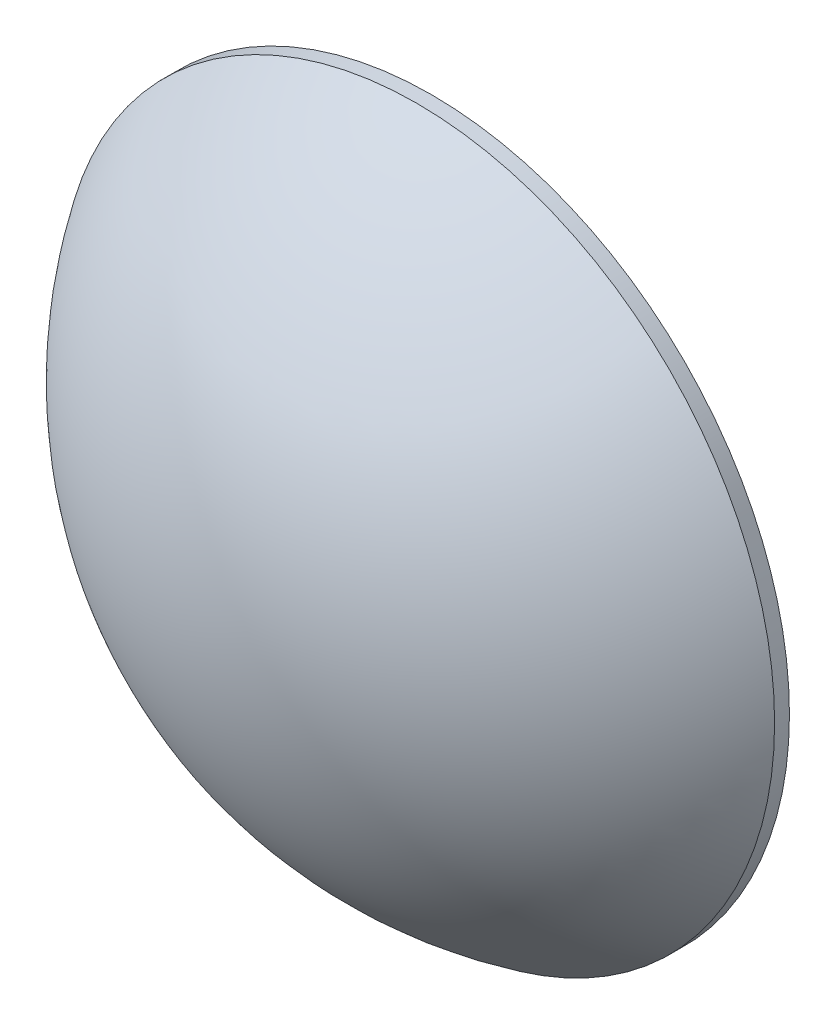
ISO-10303-21;
HEADER;
FILE_DESCRIPTION(('STEP AP214'),'2;1');
FILE_NAME('part.step','',(''),(''),'','','');
FILE_SCHEMA(('AUTOMOTIVE_DESIGN { 1 0 10303 214 1 1 1 1 }'));
ENDSEC;
DATA;
#1=APPLICATION_CONTEXT('core data for automotive mechanical design processes');
#2=APPLICATION_PROTOCOL_DEFINITION('international standard','automotive_design',2000,#1);
#3=PRODUCT_CONTEXT('',#1,'mechanical');
#4=PRODUCT('Part','Part','',(#3));
#5=PRODUCT_RELATED_PRODUCT_CATEGORY('part','',(#4));
#6=PRODUCT_DEFINITION_FORMATION('','',#4);
#7=PRODUCT_DEFINITION_CONTEXT('part definition',#1,'design');
#8=PRODUCT_DEFINITION('design','',#6,#7);
#9=PRODUCT_DEFINITION_SHAPE('','',#8);
#10=(LENGTH_UNIT() NAMED_UNIT(*) SI_UNIT(.MILLI.,.METRE.));
#11=(NAMED_UNIT(*) PLANE_ANGLE_UNIT() SI_UNIT($,.RADIAN.));
#12=(NAMED_UNIT(*) SI_UNIT($,.STERADIAN.) SOLID_ANGLE_UNIT());
#13=UNCERTAINTY_MEASURE_WITH_UNIT(LENGTH_MEASURE(1.E-05),#10,'distance_accuracy_value','');
#14=(GEOMETRIC_REPRESENTATION_CONTEXT(3) GLOBAL_UNCERTAINTY_ASSIGNED_CONTEXT((#13)) GLOBAL_UNIT_ASSIGNED_CONTEXT((#10,
#11,#12)) REPRESENTATION_CONTEXT('',''));
#15=CARTESIAN_POINT('',(0.,0.,0.));
#16=DIRECTION('',(0.,0.,1.));
#17=DIRECTION('',(1.,0.,0.));
#18=AXIS2_PLACEMENT_3D('',#15,#16,#17);
#19=CARTESIAN_POINT('',(0.,0.,-22.9399588138106));
#20=DIRECTION('',(0.,0.,1.));
#21=DIRECTION('',(0.,1.,0.));
#22=AXIS2_PLACEMENT_3D('',#19,#20,#21);
#23=SPHERICAL_SURFACE('',#22,30.34);
#24=CARTESIAN_POINT('',(0.,0.,-6.34611658242851));
#25=DIRECTION('',(0.,0.,1.));
#26=DIRECTION('',(1.,0.,0.));
#27=AXIS2_PLACEMENT_3D('',#24,#25,#26);
#28=CIRCLE('',#27,25.4);
#29=CARTESIAN_POINT('',(25.4,0.,-6.34611658242851));
#30=VERTEX_POINT('',#29);
#31=EDGE_CURVE('E8',#30,#30,#28,.T.);
#32=ORIENTED_EDGE('',*,*,#31,.T.);
#33=EDGE_LOOP('',(#32));
#34=FACE_BOUND('',#33,.T.);
#35=ADVANCED_FACE('F12',(#34),#23,.T.);
#36=CARTESIAN_POINT('',(0.,0.,11.4551449410304));
#37=DIRECTION('',(0.,0.,1.));
#38=DIRECTION('',(1.,0.,0.));
#39=AXIS2_PLACEMENT_3D('',#36,#37,#38);
#40=CYLINDRICAL_SURFACE('',#39,25.4);
#41=ORIENTED_EDGE('',*,*,#31,.F.);
#42=EDGE_LOOP('',(#41));
#43=FACE_BOUND('',#42,.T.);
#44=CARTESIAN_POINT('',(0.,0.,-7.40004118618939));
#45=DIRECTION('',(0.,0.,1.));
#46=DIRECTION('',(1.,0.,0.));
#47=AXIS2_PLACEMENT_3D('',#44,#45,#46);
#48=CIRCLE('',#47,25.4);
#49=CARTESIAN_POINT('',(25.4,0.,-7.40004118618939));
#50=VERTEX_POINT('',#49);
#51=EDGE_CURVE('E18',#50,#50,#48,.T.);
#52=ORIENTED_EDGE('',*,*,#51,.T.);
#53=EDGE_LOOP('',(#52));
#54=FACE_BOUND('',#53,.T.);
#55=ADVANCED_FACE('F24',(#43,#54),#40,.T.);
#56=CARTESIAN_POINT('',(0.,0.,-68.0999588138106));
#57=DIRECTION('',(0.,0.,1.));
#58=DIRECTION('',(0.,1.,0.));
#59=AXIS2_PLACEMENT_3D('',#56,#57,#58);
#60=SPHERICAL_SURFACE('',#59,65.8);
#61=ORIENTED_EDGE('',*,*,#51,.F.);
#62=EDGE_LOOP('',(#61));
#63=FACE_BOUND('',#62,.T.);
#64=ADVANCED_FACE('F26',(#63),#60,.F.);
#65=CLOSED_SHELL('',(#35,#55,#64));
#66=MANIFOLD_SOLID_BREP('B1',#65);
#67=ADVANCED_BREP_SHAPE_REPRESENTATION('',(#18,#66),#14);
#68=SHAPE_DEFINITION_REPRESENTATION(#9,#67);
ENDSEC;
END-ISO-10303-21;
